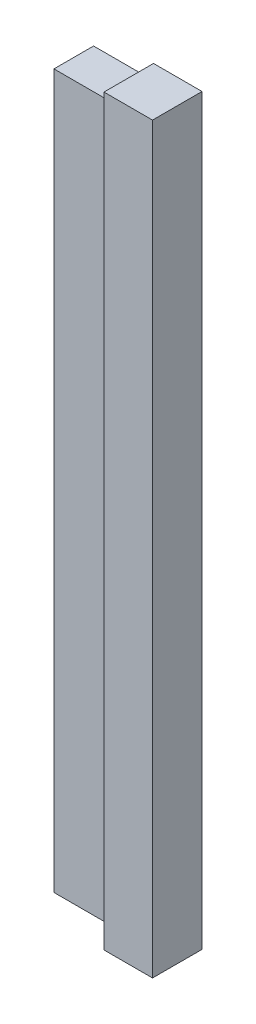
ISO-10303-21;
HEADER;
FILE_DESCRIPTION(('STEP AP214'),'2;1');
FILE_NAME('part.step','',(''),(''),'','','');
FILE_SCHEMA(('AUTOMOTIVE_DESIGN { 1 0 10303 214 1 1 1 1 }'));
ENDSEC;
DATA;
#1=APPLICATION_CONTEXT('core data for automotive mechanical design processes');
#2=APPLICATION_PROTOCOL_DEFINITION('international standard','automotive_design',2000,#1);
#3=PRODUCT_CONTEXT('',#1,'mechanical');
#4=PRODUCT('Part','Part','',(#3));
#5=PRODUCT_RELATED_PRODUCT_CATEGORY('part','',(#4));
#6=PRODUCT_DEFINITION_FORMATION('','',#4);
#7=PRODUCT_DEFINITION_CONTEXT('part definition',#1,'design');
#8=PRODUCT_DEFINITION('design','',#6,#7);
#9=PRODUCT_DEFINITION_SHAPE('','',#8);
#10=(LENGTH_UNIT() NAMED_UNIT(*) SI_UNIT(.MILLI.,.METRE.));
#11=(NAMED_UNIT(*) PLANE_ANGLE_UNIT() SI_UNIT($,.RADIAN.));
#12=(NAMED_UNIT(*) SI_UNIT($,.STERADIAN.) SOLID_ANGLE_UNIT());
#13=UNCERTAINTY_MEASURE_WITH_UNIT(LENGTH_MEASURE(1.E-05),#10,'distance_accuracy_value','');
#14=(GEOMETRIC_REPRESENTATION_CONTEXT(3) GLOBAL_UNCERTAINTY_ASSIGNED_CONTEXT((#13)) GLOBAL_UNIT_ASSIGNED_CONTEXT((#10,
#11,#12)) REPRESENTATION_CONTEXT('',''));
#15=CARTESIAN_POINT('',(0.,0.,0.));
#16=DIRECTION('',(0.,0.,1.));
#17=DIRECTION('',(1.,0.,0.));
#18=AXIS2_PLACEMENT_3D('',#15,#16,#17);
#19=CARTESIAN_POINT('',(-21.775,18.75,4.1));
#20=DIRECTION('',(1.,0.,0.));
#21=DIRECTION('',(0.,1.,0.));
#22=AXIS2_PLACEMENT_3D('',#19,#20,#21);
#23=PLANE('',#22);
#24=DIRECTION('',(0.,-1.,0.));
#25=VECTOR('',#24,1.);
#26=CARTESIAN_POINT('',(-21.775,18.75,1.6));
#27=LINE('',#26,#25);
#28=CARTESIAN_POINT('',(-21.775,18.75,1.6));
#29=VERTEX_POINT('',#28);
#30=CARTESIAN_POINT('',(-21.775,-18.75,1.6));
#31=VERTEX_POINT('',#30);
#32=EDGE_CURVE('P0_E96',#29,#31,#27,.T.);
#33=ORIENTED_EDGE('',*,*,#32,.T.);
#34=DIRECTION('',(0.,0.,-1.));
#35=VECTOR('',#34,1.);
#36=CARTESIAN_POINT('',(-21.775,-18.75,4.1));
#37=LINE('',#36,#35);
#38=CARTESIAN_POINT('',(-21.775,-18.75,4.1));
#39=VERTEX_POINT('',#38);
#40=EDGE_CURVE('P0_E11',#39,#31,#37,.T.);
#41=ORIENTED_EDGE('',*,*,#40,.F.);
#42=DIRECTION('',(0.,-1.,0.));
#43=VECTOR('',#42,1.);
#44=CARTESIAN_POINT('',(-21.775,18.75,4.1));
#45=LINE('',#44,#43);
#46=CARTESIAN_POINT('',(-21.775,18.75,4.1));
#47=VERTEX_POINT('',#46);
#48=EDGE_CURVE('P0_E84',#47,#39,#45,.T.);
#49=ORIENTED_EDGE('',*,*,#48,.F.);
#50=DIRECTION('',(0.,0.,-1.));
#51=VECTOR('',#50,1.);
#52=CARTESIAN_POINT('',(-21.775,18.75,4.1));
#53=LINE('',#52,#51);
#54=EDGE_CURVE('P0_E92',#47,#29,#53,.T.);
#55=ORIENTED_EDGE('',*,*,#54,.T.);
#56=EDGE_LOOP('',(#33,#41,#49,#55));
#57=FACE_BOUND('',#56,.T.);
#58=ADVANCED_FACE('P0_F33',(#57),#23,.F.);
#59=CARTESIAN_POINT('',(-21.775,-18.75,4.1));
#60=DIRECTION('',(0.,1.,0.));
#61=DIRECTION('',(0.,0.,1.));
#62=AXIS2_PLACEMENT_3D('',#59,#60,#61);
#63=PLANE('',#62);
#64=DIRECTION('',(1.,0.,0.));
#65=VECTOR('',#64,1.);
#66=CARTESIAN_POINT('',(-21.775,-18.75,1.6));
#67=LINE('',#66,#65);
#68=CARTESIAN_POINT('',(-19.325,-18.75,1.6));
#69=VERTEX_POINT('',#68);
#70=EDGE_CURVE('P0_E88',#31,#69,#67,.T.);
#71=ORIENTED_EDGE('',*,*,#70,.T.);
#72=DIRECTION('',(0.,0.,-1.));
#73=VECTOR('',#72,1.);
#74=CARTESIAN_POINT('',(-19.325,-18.75,4.1));
#75=LINE('',#74,#73);
#76=CARTESIAN_POINT('',(-19.325,-18.75,4.1));
#77=VERTEX_POINT('',#76);
#78=EDGE_CURVE('P0_E41',#77,#69,#75,.T.);
#79=ORIENTED_EDGE('',*,*,#78,.F.);
#80=DIRECTION('',(1.,0.,0.));
#81=VECTOR('',#80,1.);
#82=CARTESIAN_POINT('',(-21.775,-18.75,4.1));
#83=LINE('',#82,#81);
#84=EDGE_CURVE('P0_E79',#39,#77,#83,.T.);
#85=ORIENTED_EDGE('',*,*,#84,.F.);
#86=ORIENTED_EDGE('',*,*,#40,.T.);
#87=EDGE_LOOP('',(#71,#79,#85,#86));
#88=FACE_BOUND('',#87,.T.);
#89=ADVANCED_FACE('P0_F87',(#88),#63,.F.);
#90=CARTESIAN_POINT('',(-19.325,18.75,4.1));
#91=DIRECTION('',(-1.,0.,0.));
#92=DIRECTION('',(0.,0.,1.));
#93=AXIS2_PLACEMENT_3D('',#90,#91,#92);
#94=PLANE('',#93);
#95=DIRECTION('',(0.,1.,0.));
#96=VECTOR('',#95,1.);
#97=CARTESIAN_POINT('',(-19.325,18.75,1.6));
#98=LINE('',#97,#96);
#99=CARTESIAN_POINT('',(-19.325,18.75,1.6));
#100=VERTEX_POINT('',#99);
#101=EDGE_CURVE('P0_E66',#69,#100,#98,.T.);
#102=ORIENTED_EDGE('',*,*,#101,.T.);
#103=DIRECTION('',(0.,0.,-1.));
#104=VECTOR('',#103,1.);
#105=CARTESIAN_POINT('',(-19.325,18.75,4.1));
#106=LINE('',#105,#104);
#107=CARTESIAN_POINT('',(-19.325,18.75,4.1));
#108=VERTEX_POINT('',#107);
#109=EDGE_CURVE('P0_E89',#108,#100,#106,.T.);
#110=ORIENTED_EDGE('',*,*,#109,.F.);
#111=DIRECTION('',(0.,1.,0.));
#112=VECTOR('',#111,1.);
#113=CARTESIAN_POINT('',(-19.325,18.75,4.1));
#114=LINE('',#113,#112);
#115=EDGE_CURVE('P0_E82',#77,#108,#114,.T.);
#116=ORIENTED_EDGE('',*,*,#115,.F.);
#117=ORIENTED_EDGE('',*,*,#78,.T.);
#118=EDGE_LOOP('',(#102,#110,#116,#117));
#119=FACE_BOUND('',#118,.T.);
#120=ADVANCED_FACE('P0_F90',(#119),#94,.F.);
#121=CARTESIAN_POINT('',(-21.775,18.75,4.1));
#122=DIRECTION('',(0.,-1.,0.));
#123=DIRECTION('',(1.,0.,0.));
#124=AXIS2_PLACEMENT_3D('',#121,#122,#123);
#125=PLANE('',#124);
#126=DIRECTION('',(-1.,0.,0.));
#127=VECTOR('',#126,1.);
#128=CARTESIAN_POINT('',(-21.775,18.75,1.6));
#129=LINE('',#128,#127);
#130=EDGE_CURVE('P0_E72',#100,#29,#129,.T.);
#131=ORIENTED_EDGE('',*,*,#130,.T.);
#132=ORIENTED_EDGE('',*,*,#54,.F.);
#133=DIRECTION('',(-1.,0.,0.));
#134=VECTOR('',#133,1.);
#135=CARTESIAN_POINT('',(-21.775,18.75,4.1));
#136=LINE('',#135,#134);
#137=EDGE_CURVE('P0_E49',#108,#47,#136,.T.);
#138=ORIENTED_EDGE('',*,*,#137,.F.);
#139=ORIENTED_EDGE('',*,*,#109,.T.);
#140=EDGE_LOOP('',(#131,#132,#138,#139));
#141=FACE_BOUND('',#140,.T.);
#142=ADVANCED_FACE('P0_F103',(#141),#125,.F.);
#143=CARTESIAN_POINT('',(0.,0.,4.1));
#144=DIRECTION('',(0.,0.,1.));
#145=DIRECTION('',(1.,0.,0.));
#146=AXIS2_PLACEMENT_3D('',#143,#144,#145);
#147=PLANE('',#146);
#148=ORIENTED_EDGE('',*,*,#48,.T.);
#149=ORIENTED_EDGE('',*,*,#84,.T.);
#150=ORIENTED_EDGE('',*,*,#115,.T.);
#151=ORIENTED_EDGE('',*,*,#137,.T.);
#152=EDGE_LOOP('',(#148,#149,#150,#151));
#153=FACE_BOUND('',#152,.T.);
#154=ADVANCED_FACE('P0_F80',(#153),#147,.T.);
#155=CARTESIAN_POINT('',(0.,0.,1.6));
#156=DIRECTION('',(0.,0.,1.));
#157=DIRECTION('',(1.,0.,0.));
#158=AXIS2_PLACEMENT_3D('',#155,#156,#157);
#159=PLANE('',#158);
#160=ORIENTED_EDGE('',*,*,#32,.F.);
#161=ORIENTED_EDGE('',*,*,#130,.F.);
#162=ORIENTED_EDGE('',*,*,#101,.F.);
#163=ORIENTED_EDGE('',*,*,#70,.F.);
#164=EDGE_LOOP('',(#160,#161,#162,#163));
#165=FACE_BOUND('',#164,.T.);
#166=ADVANCED_FACE('P0_F106',(#165),#159,.F.);
#167=CLOSED_SHELL('',(#58,#89,#120,#142,#154,#166));
#168=MANIFOLD_SOLID_BREP('P0_B2',#167);
#169=CARTESIAN_POINT('',(-23.3,0.,3.6));
#170=DIRECTION('',(0.,0.,-1.));
#171=DIRECTION('',(-1.,0.,0.));
#172=AXIS2_PLACEMENT_3D('',#169,#170,#171);
#173=PLANE('',#172);
#174=DIRECTION('',(1.,0.,0.));
#175=VECTOR('',#174,1.);
#176=CARTESIAN_POINT('',(-21.8,-18.,3.6));
#177=LINE('',#176,#175);
#178=CARTESIAN_POINT('',(-21.8,-18.,3.6));
#179=VERTEX_POINT('',#178);
#180=CARTESIAN_POINT('',(-24.8,-18.,3.6));
#181=VERTEX_POINT('',#180);
#182=EDGE_CURVE('P1_E67',#179,#181,#177,.F.);
#183=ORIENTED_EDGE('',*,*,#182,.F.);
#184=DIRECTION('',(0.,1.,0.));
#185=VECTOR('',#184,1.);
#186=CARTESIAN_POINT('',(-21.8,18.,3.6));
#187=LINE('',#186,#185);
#188=CARTESIAN_POINT('',(-21.8,18.,3.6));
#189=VERTEX_POINT('',#188);
#190=EDGE_CURVE('P1_E54',#189,#179,#187,.F.);
#191=ORIENTED_EDGE('',*,*,#190,.F.);
#192=DIRECTION('',(1.,0.,0.));
#193=VECTOR('',#192,1.);
#194=CARTESIAN_POINT('',(-24.8,18.,3.6));
#195=LINE('',#194,#193);
#196=CARTESIAN_POINT('',(-24.8,18.,3.6));
#197=VERTEX_POINT('',#196);
#198=EDGE_CURVE('P1_E19',#197,#189,#195,.T.);
#199=ORIENTED_EDGE('',*,*,#198,.F.);
#200=DIRECTION('',(0.,1.,0.));
#201=VECTOR('',#200,1.);
#202=CARTESIAN_POINT('',(-24.8,-18.,3.6));
#203=LINE('',#202,#201);
#204=EDGE_CURVE('P1_E79',#181,#197,#203,.T.);
#205=ORIENTED_EDGE('',*,*,#204,.F.);
#206=EDGE_LOOP('',(#183,#191,#199,#205));
#207=FACE_BOUND('',#206,.T.);
#208=ADVANCED_FACE('P1_F16',(#207),#173,.F.);
#209=CARTESIAN_POINT('',(-24.8,18.,1.6));
#210=DIRECTION('',(0.,1.,0.));
#211=DIRECTION('',(0.,0.,1.));
#212=AXIS2_PLACEMENT_3D('',#209,#210,#211);
#213=PLANE('',#212);
#214=DIRECTION('',(0.,0.,-1.));
#215=VECTOR('',#214,1.);
#216=CARTESIAN_POINT('',(-21.8,18.,1.6));
#217=LINE('',#216,#215);
#218=CARTESIAN_POINT('',(-21.8,18.,1.6));
#219=VERTEX_POINT('',#218);
#220=EDGE_CURVE('P1_E60',#219,#189,#217,.F.);
#221=ORIENTED_EDGE('',*,*,#220,.F.);
#222=DIRECTION('',(-1.,0.,0.));
#223=VECTOR('',#222,1.);
#224=CARTESIAN_POINT('',(-23.3,18.,1.6));
#225=LINE('',#224,#223);
#226=CARTESIAN_POINT('',(-24.8,18.,1.6));
#227=VERTEX_POINT('',#226);
#228=EDGE_CURVE('P1_E82',#227,#219,#225,.F.);
#229=ORIENTED_EDGE('',*,*,#228,.F.);
#230=DIRECTION('',(0.,0.,1.));
#231=VECTOR('',#230,1.);
#232=CARTESIAN_POINT('',(-24.8,18.,1.6));
#233=LINE('',#232,#231);
#234=EDGE_CURVE('P1_E63',#197,#227,#233,.F.);
#235=ORIENTED_EDGE('',*,*,#234,.F.);
#236=ORIENTED_EDGE('',*,*,#198,.T.);
#237=EDGE_LOOP('',(#221,#229,#235,#236));
#238=FACE_BOUND('',#237,.T.);
#239=ADVANCED_FACE('P1_F59',(#238),#213,.T.);
#240=CARTESIAN_POINT('',(-21.8,18.,1.6));
#241=DIRECTION('',(1.,0.,0.));
#242=DIRECTION('',(0.,0.,-1.));
#243=AXIS2_PLACEMENT_3D('',#240,#241,#242);
#244=PLANE('',#243);
#245=DIRECTION('',(0.,0.,-1.));
#246=VECTOR('',#245,1.);
#247=CARTESIAN_POINT('',(-21.8,-18.,1.6));
#248=LINE('',#247,#246);
#249=CARTESIAN_POINT('',(-21.8,-18.,1.6));
#250=VERTEX_POINT('',#249);
#251=EDGE_CURVE('P1_E69',#250,#179,#248,.F.);
#252=ORIENTED_EDGE('',*,*,#251,.F.);
#253=DIRECTION('',(0.,1.,0.));
#254=VECTOR('',#253,1.);
#255=CARTESIAN_POINT('',(-21.8,0.,1.6));
#256=LINE('',#255,#254);
#257=EDGE_CURVE('P1_E73',#219,#250,#256,.F.);
#258=ORIENTED_EDGE('',*,*,#257,.F.);
#259=ORIENTED_EDGE('',*,*,#220,.T.);
#260=ORIENTED_EDGE('',*,*,#190,.T.);
#261=EDGE_LOOP('',(#252,#258,#259,#260));
#262=FACE_BOUND('',#261,.T.);
#263=ADVANCED_FACE('P1_F71',(#262),#244,.T.);
#264=CARTESIAN_POINT('',(-21.8,-18.,1.6));
#265=DIRECTION('',(0.,-1.,0.));
#266=DIRECTION('',(0.,0.,-1.));
#267=AXIS2_PLACEMENT_3D('',#264,#265,#266);
#268=PLANE('',#267);
#269=DIRECTION('',(0.,0.,1.));
#270=VECTOR('',#269,1.);
#271=CARTESIAN_POINT('',(-24.8,-18.,1.6));
#272=LINE('',#271,#270);
#273=CARTESIAN_POINT('',(-24.8,-18.,1.6));
#274=VERTEX_POINT('',#273);
#275=EDGE_CURVE('P1_E34',#274,#181,#272,.T.);
#276=ORIENTED_EDGE('',*,*,#275,.F.);
#277=DIRECTION('',(-1.,0.,0.));
#278=VECTOR('',#277,1.);
#279=CARTESIAN_POINT('',(-23.3,-18.,1.6));
#280=LINE('',#279,#278);
#281=EDGE_CURVE('P1_E25',#250,#274,#280,.T.);
#282=ORIENTED_EDGE('',*,*,#281,.F.);
#283=ORIENTED_EDGE('',*,*,#251,.T.);
#284=ORIENTED_EDGE('',*,*,#182,.T.);
#285=EDGE_LOOP('',(#276,#282,#283,#284));
#286=FACE_BOUND('',#285,.T.);
#287=ADVANCED_FACE('P1_F88',(#286),#268,.T.);
#288=CARTESIAN_POINT('',(-24.8,-18.,1.6));
#289=DIRECTION('',(-1.,0.,0.));
#290=DIRECTION('',(0.,0.,1.));
#291=AXIS2_PLACEMENT_3D('',#288,#289,#290);
#292=PLANE('',#291);
#293=ORIENTED_EDGE('',*,*,#234,.T.);
#294=DIRECTION('',(0.,1.,0.));
#295=VECTOR('',#294,1.);
#296=CARTESIAN_POINT('',(-24.8,0.,1.6));
#297=LINE('',#296,#295);
#298=EDGE_CURVE('P1_E11',#274,#227,#297,.T.);
#299=ORIENTED_EDGE('',*,*,#298,.F.);
#300=ORIENTED_EDGE('',*,*,#275,.T.);
#301=ORIENTED_EDGE('',*,*,#204,.T.);
#302=EDGE_LOOP('',(#293,#299,#300,#301));
#303=FACE_BOUND('',#302,.T.);
#304=ADVANCED_FACE('P1_F90',(#303),#292,.T.);
#305=CARTESIAN_POINT('',(-23.3,0.,1.6));
#306=DIRECTION('',(0.,0.,-1.));
#307=DIRECTION('',(-1.,0.,0.));
#308=AXIS2_PLACEMENT_3D('',#305,#306,#307);
#309=PLANE('',#308);
#310=ORIENTED_EDGE('',*,*,#281,.T.);
#311=ORIENTED_EDGE('',*,*,#298,.T.);
#312=ORIENTED_EDGE('',*,*,#228,.T.);
#313=ORIENTED_EDGE('',*,*,#257,.T.);
#314=EDGE_LOOP('',(#310,#311,#312,#313));
#315=FACE_BOUND('',#314,.T.);
#316=ADVANCED_FACE('P1_F87',(#315),#309,.T.);
#317=CLOSED_SHELL('',(#208,#239,#263,#287,#304,#316));
#318=MANIFOLD_SOLID_BREP('P1_B1',#317);
#319=ADVANCED_BREP_SHAPE_REPRESENTATION('',(#18,#168,#318),#14);
#320=SHAPE_DEFINITION_REPRESENTATION(#9,#319);
ENDSEC;
END-ISO-10303-21;
